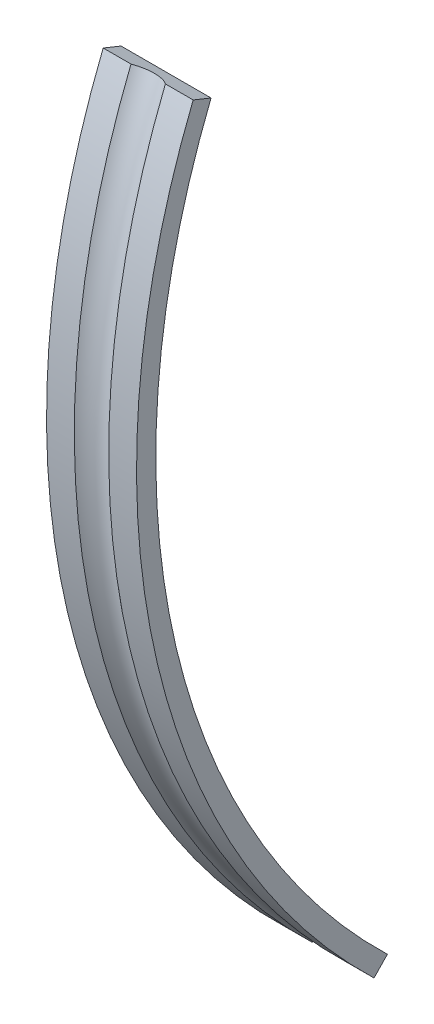
ISO-10303-21;
HEADER;
FILE_DESCRIPTION(('STEP AP214'),'2;1');
FILE_NAME('part.step','',(''),(''),'','','');
FILE_SCHEMA(('AUTOMOTIVE_DESIGN { 1 0 10303 214 1 1 1 1 }'));
ENDSEC;
DATA;
#1=APPLICATION_CONTEXT('core data for automotive mechanical design processes');
#2=APPLICATION_PROTOCOL_DEFINITION('international standard','automotive_design',2000,#1);
#3=PRODUCT_CONTEXT('',#1,'mechanical');
#4=PRODUCT('Part','Part','',(#3));
#5=PRODUCT_RELATED_PRODUCT_CATEGORY('part','',(#4));
#6=PRODUCT_DEFINITION_FORMATION('','',#4);
#7=PRODUCT_DEFINITION_CONTEXT('part definition',#1,'design');
#8=PRODUCT_DEFINITION('design','',#6,#7);
#9=PRODUCT_DEFINITION_SHAPE('','',#8);
#10=(LENGTH_UNIT() NAMED_UNIT(*) SI_UNIT(.MILLI.,.METRE.));
#11=(NAMED_UNIT(*) PLANE_ANGLE_UNIT() SI_UNIT($,.RADIAN.));
#12=(NAMED_UNIT(*) SI_UNIT($,.STERADIAN.) SOLID_ANGLE_UNIT());
#13=UNCERTAINTY_MEASURE_WITH_UNIT(LENGTH_MEASURE(1.E-05),#10,'distance_accuracy_value','');
#14=(GEOMETRIC_REPRESENTATION_CONTEXT(3) GLOBAL_UNCERTAINTY_ASSIGNED_CONTEXT((#13)) GLOBAL_UNIT_ASSIGNED_CONTEXT((#10,
#11,#12)) REPRESENTATION_CONTEXT('',''));
#15=CARTESIAN_POINT('',(0.,0.,0.));
#16=DIRECTION('',(0.,0.,1.));
#17=DIRECTION('',(1.,0.,0.));
#18=AXIS2_PLACEMENT_3D('',#15,#16,#17);
#19=CARTESIAN_POINT('',(-10.4382032302755,-42.4410482199806,40.9848438570807));
#20=DIRECTION('',(0.,-0.694658370459007,-0.719339800338642));
#21=DIRECTION('',(0.,0.719339800338642,-0.694658370459007));
#22=AXIS2_PLACEMENT_3D('',#19,#20,#21);
#23=PLANE('',#22);
#24=DIRECTION('',(0.,-0.719339800338642,0.694658370459007));
#25=VECTOR('',#24,1.);
#26=CARTESIAN_POINT('',(3.42820323027553,-6.74564990502644E-13,-6.98650483141471E-13));
#27=LINE('',#26,#25);
#28=CARTESIAN_POINT('',(3.42820323027554,-42.4410482199806,40.9848438570807));
#29=VERTEX_POINT('',#28);
#30=CARTESIAN_POINT('',(3.42820323027554,-43.5200579204885,42.0268314127692));
#31=VERTEX_POINT('',#30);
#32=EDGE_CURVE('E139',#29,#31,#27,.T.);
#33=ORIENTED_EDGE('',*,*,#32,.F.);
#34=DIRECTION('',(1.,0.,0.));
#35=VECTOR('',#34,1.);
#36=CARTESIAN_POINT('',(-10.4282032302755,-42.4410482199806,40.9848438570807));
#37=LINE('',#36,#35);
#38=CARTESIAN_POINT('',(10.4282032302755,-42.4410482199806,40.9848438570807));
#39=VERTEX_POINT('',#38);
#40=EDGE_CURVE('E11',#29,#39,#37,.T.);
#41=ORIENTED_EDGE('',*,*,#40,.T.);
#42=DIRECTION('',(0.,0.719339800338642,-0.694658370459007));
#43=VECTOR('',#42,1.);
#44=CARTESIAN_POINT('',(10.4282032302755,-6.74822502490658E-13,-6.9879915775707E-13));
#45=LINE('',#44,#43);
#46=CARTESIAN_POINT('',(10.4282032302755,-43.5200579204885,42.0268314127692));
#47=VERTEX_POINT('',#46);
#48=EDGE_CURVE('E117',#47,#39,#45,.T.);
#49=ORIENTED_EDGE('',*,*,#48,.F.);
#50=DIRECTION('',(1.,0.,0.));
#51=VECTOR('',#50,1.);
#52=CARTESIAN_POINT('',(-10.4382032302755,-43.5200579204885,42.0268314127692));
#53=LINE('',#52,#51);
#54=CARTESIAN_POINT('',(8.26614941753421,-43.5200579204885,42.0268314127692));
#55=VERTEX_POINT('',#54);
#56=EDGE_CURVE('E120',#55,#47,#53,.T.);
#57=ORIENTED_EDGE('',*,*,#56,.F.);
#58=CARTESIAN_POINT('',(6.92820323027553,-44.5990676209958,43.0688189684584));
#59=DIRECTION('',(0.,-0.694658370459007,-0.719339800338642));
#60=DIRECTION('',(0.,0.719339800338642,-0.694658370459007));
#61=AXIS2_PLACEMENT_3D('',#58,#59,#60);
#62=CIRCLE('',#61,2.01);
#63=CARTESIAN_POINT('',(5.59025704301686,-43.5200579204885,42.0268314127692));
#64=VERTEX_POINT('',#63);
#65=EDGE_CURVE('E129',#55,#64,#62,.F.);
#66=ORIENTED_EDGE('',*,*,#65,.T.);
#67=EDGE_CURVE('E118',#31,#64,#53,.T.);
#68=ORIENTED_EDGE('',*,*,#67,.F.);
#69=EDGE_LOOP('',(#33,#41,#49,#57,#66,#68));
#70=FACE_BOUND('',#69,.T.);
#71=ADVANCED_FACE('F45',(#70),#23,.T.);
#72=CARTESIAN_POINT('',(-10.4382032302755,22.1017890115388,54.7038474194405));
#73=DIRECTION('',(0.,0.927183854566786,-0.374606593415914));
#74=DIRECTION('',(0.,0.374606593415914,0.927183854566787));
#75=AXIS2_PLACEMENT_3D('',#72,#73,#74);
#76=PLANE('',#75);
#77=DIRECTION('',(0.,-0.374606593415914,-0.927183854566787));
#78=VECTOR('',#77,1.);
#79=CARTESIAN_POINT('',(3.42820323027553,-1.57366432720226E-13,0.));
#80=LINE('',#79,#78);
#81=CARTESIAN_POINT('',(3.42820323027553,22.6636989016627,56.0946232012907));
#82=VERTEX_POINT('',#81);
#83=CARTESIAN_POINT('',(3.42820323027554,22.1017890115388,54.7038474194405));
#84=VERTEX_POINT('',#83);
#85=EDGE_CURVE('E133',#82,#84,#80,.T.);
#86=ORIENTED_EDGE('',*,*,#85,.F.);
#87=DIRECTION('',(1.,0.,0.));
#88=VECTOR('',#87,1.);
#89=CARTESIAN_POINT('',(-10.4382032302755,22.6636989016627,56.0946232012906));
#90=LINE('',#89,#88);
#91=CARTESIAN_POINT('',(5.59025704301686,22.6636989016628,56.0946232012906));
#92=VERTEX_POINT('',#91);
#93=EDGE_CURVE('E134',#82,#92,#90,.T.);
#94=ORIENTED_EDGE('',*,*,#93,.T.);
#95=CARTESIAN_POINT('',(6.92820323027553,23.2256087917867,57.4853989831408));
#96=DIRECTION('',(0.,0.927183854566786,-0.374606593415914));
#97=DIRECTION('',(0.,0.374606593415914,0.927183854566787));
#98=AXIS2_PLACEMENT_3D('',#95,#96,#97);
#99=CIRCLE('',#98,2.01);
#100=CARTESIAN_POINT('',(8.2661494175342,22.6636989016628,56.0946232012906));
#101=VERTEX_POINT('',#100);
#102=EDGE_CURVE('E53',#92,#101,#99,.F.);
#103=ORIENTED_EDGE('',*,*,#102,.T.);
#104=CARTESIAN_POINT('',(10.4282032302755,22.6636989016627,56.0946232012907));
#105=VERTEX_POINT('',#104);
#106=EDGE_CURVE('E109',#101,#105,#90,.T.);
#107=ORIENTED_EDGE('',*,*,#106,.T.);
#108=DIRECTION('',(0.,0.374606593415914,0.927183854566787));
#109=VECTOR('',#108,1.);
#110=CARTESIAN_POINT('',(10.4282032302755,-1.5762394470824E-13,0.));
#111=LINE('',#110,#109);
#112=CARTESIAN_POINT('',(10.4282032302755,22.1017890115388,54.7038474194405));
#113=VERTEX_POINT('',#112);
#114=EDGE_CURVE('E106',#113,#105,#111,.T.);
#115=ORIENTED_EDGE('',*,*,#114,.F.);
#116=DIRECTION('',(1.,0.,0.));
#117=VECTOR('',#116,1.);
#118=CARTESIAN_POINT('',(-10.4282032302755,22.1017890115388,54.7038474194405));
#119=LINE('',#118,#117);
#120=EDGE_CURVE('E99',#84,#113,#119,.T.);
#121=ORIENTED_EDGE('',*,*,#120,.F.);
#122=EDGE_LOOP('',(#86,#94,#103,#107,#115,#121));
#123=FACE_BOUND('',#122,.T.);
#124=ADVANCED_FACE('F107',(#123),#76,.T.);
#125=CARTESIAN_POINT('',(-10.4382032302755,0.,0.));
#126=DIRECTION('',(1.,0.,0.));
#127=DIRECTION('',(0.,0.,-1.));
#128=AXIS2_PLACEMENT_3D('',#125,#126,#127);
#129=CYLINDRICAL_SURFACE('',#128,60.5);
#130=CARTESIAN_POINT('',(3.42820323027554,0.,0.));
#131=DIRECTION('',(-1.,0.,0.));
#132=DIRECTION('',(0.,0.,1.));
#133=AXIS2_PLACEMENT_3D('',#130,#131,#132);
#134=CIRCLE('',#133,60.5);
#135=EDGE_CURVE('E48',#31,#82,#134,.T.);
#136=ORIENTED_EDGE('',*,*,#135,.F.);
#137=ORIENTED_EDGE('',*,*,#67,.T.);
#138=CARTESIAN_POINT('',(5.59025704301686,0.,0.));
#139=DIRECTION('',(1.,0.,0.));
#140=DIRECTION('',(0.,0.,-1.));
#141=AXIS2_PLACEMENT_3D('',#138,#139,#140);
#142=CIRCLE('',#141,60.5);
#143=EDGE_CURVE('E124',#64,#92,#142,.F.);
#144=ORIENTED_EDGE('',*,*,#143,.T.);
#145=ORIENTED_EDGE('',*,*,#93,.F.);
#146=EDGE_LOOP('',(#136,#137,#144,#145));
#147=FACE_BOUND('',#146,.T.);
#148=ADVANCED_FACE('F144',(#147),#129,.T.);
#149=ORIENTED_EDGE('',*,*,#106,.F.);
#150=CARTESIAN_POINT('',(8.26614941753421,0.,0.));
#151=DIRECTION('',(-1.,0.,0.));
#152=DIRECTION('',(0.,0.,1.));
#153=AXIS2_PLACEMENT_3D('',#150,#151,#152);
#154=CIRCLE('',#153,60.5);
#155=EDGE_CURVE('E127',#101,#55,#154,.F.);
#156=ORIENTED_EDGE('',*,*,#155,.T.);
#157=ORIENTED_EDGE('',*,*,#56,.T.);
#158=CARTESIAN_POINT('',(10.4282032302755,0.,0.));
#159=DIRECTION('',(1.,0.,0.));
#160=DIRECTION('',(0.,0.,-1.));
#161=AXIS2_PLACEMENT_3D('',#158,#159,#160);
#162=CIRCLE('',#161,60.5);
#163=EDGE_CURVE('E113',#105,#47,#162,.T.);
#164=ORIENTED_EDGE('',*,*,#163,.F.);
#165=EDGE_LOOP('',(#149,#156,#157,#164));
#166=FACE_BOUND('',#165,.T.);
#167=ADVANCED_FACE('F152',(#166),#129,.T.);
#168=CARTESIAN_POINT('',(10.4282032302755,0.,0.));
#169=DIRECTION('',(1.,0.,0.));
#170=DIRECTION('',(0.,0.,1.));
#171=AXIS2_PLACEMENT_3D('',#168,#169,#170);
#172=PLANE('',#171);
#173=ORIENTED_EDGE('',*,*,#163,.T.);
#174=ORIENTED_EDGE('',*,*,#48,.T.);
#175=CARTESIAN_POINT('',(10.4282032302755,0.,0.));
#176=DIRECTION('',(1.,0.,0.));
#177=DIRECTION('',(0.,0.,-1.));
#178=AXIS2_PLACEMENT_3D('',#175,#176,#177);
#179=CIRCLE('',#178,59.);
#180=EDGE_CURVE('E61',#113,#39,#179,.T.);
#181=ORIENTED_EDGE('',*,*,#180,.F.);
#182=ORIENTED_EDGE('',*,*,#114,.T.);
#183=EDGE_LOOP('',(#173,#174,#181,#182));
#184=FACE_BOUND('',#183,.T.);
#185=ADVANCED_FACE('F115',(#184),#172,.T.);
#186=CARTESIAN_POINT('',(3.42820323027553,0.,0.));
#187=DIRECTION('',(-1.,0.,0.));
#188=DIRECTION('',(0.,0.,-1.));
#189=AXIS2_PLACEMENT_3D('',#186,#187,#188);
#190=PLANE('',#189);
#191=CARTESIAN_POINT('',(3.42820323027554,0.,0.));
#192=DIRECTION('',(-1.,0.,0.));
#193=DIRECTION('',(0.,0.,1.));
#194=AXIS2_PLACEMENT_3D('',#191,#192,#193);
#195=CIRCLE('',#194,59.);
#196=EDGE_CURVE('E69',#29,#84,#195,.T.);
#197=ORIENTED_EDGE('',*,*,#196,.F.);
#198=ORIENTED_EDGE('',*,*,#32,.T.);
#199=ORIENTED_EDGE('',*,*,#135,.T.);
#200=ORIENTED_EDGE('',*,*,#85,.T.);
#201=EDGE_LOOP('',(#197,#198,#199,#200));
#202=FACE_BOUND('',#201,.T.);
#203=ADVANCED_FACE('F142',(#202),#190,.T.);
#204=CARTESIAN_POINT('',(-10.4282032302755,0.,0.));
#205=DIRECTION('',(1.,0.,0.));
#206=DIRECTION('',(0.,0.,-1.));
#207=AXIS2_PLACEMENT_3D('',#204,#205,#206);
#208=CYLINDRICAL_SURFACE('',#207,59.);
#209=ORIENTED_EDGE('',*,*,#196,.T.);
#210=ORIENTED_EDGE('',*,*,#120,.T.);
#211=ORIENTED_EDGE('',*,*,#180,.T.);
#212=ORIENTED_EDGE('',*,*,#40,.F.);
#213=EDGE_LOOP('',(#209,#210,#211,#212));
#214=FACE_BOUND('',#213,.T.);
#215=ADVANCED_FACE('F101',(#214),#208,.F.);
#216=CARTESIAN_POINT('',(6.92820323027553,0.,0.));
#217=DIRECTION('',(1.,0.,0.));
#218=DIRECTION('',(0.,0.,1.));
#219=AXIS2_PLACEMENT_3D('',#216,#217,#218);
#220=TOROIDAL_SURFACE('',#219,62.,2.01);
#221=ORIENTED_EDGE('',*,*,#65,.F.);
#222=ORIENTED_EDGE('',*,*,#155,.F.);
#223=ORIENTED_EDGE('',*,*,#102,.F.);
#224=ORIENTED_EDGE('',*,*,#143,.F.);
#225=EDGE_LOOP('',(#221,#222,#223,#224));
#226=FACE_BOUND('',#225,.T.);
#227=ADVANCED_FACE('F150',(#226),#220,.F.);
#228=CLOSED_SHELL('',(#71,#124,#148,#167,#185,#203,#215,#227));
#229=MANIFOLD_SOLID_BREP('B2',#228);
#230=ADVANCED_BREP_SHAPE_REPRESENTATION('',(#18,#229),#14);
#231=SHAPE_DEFINITION_REPRESENTATION(#9,#230);
ENDSEC;
END-ISO-10303-21;
